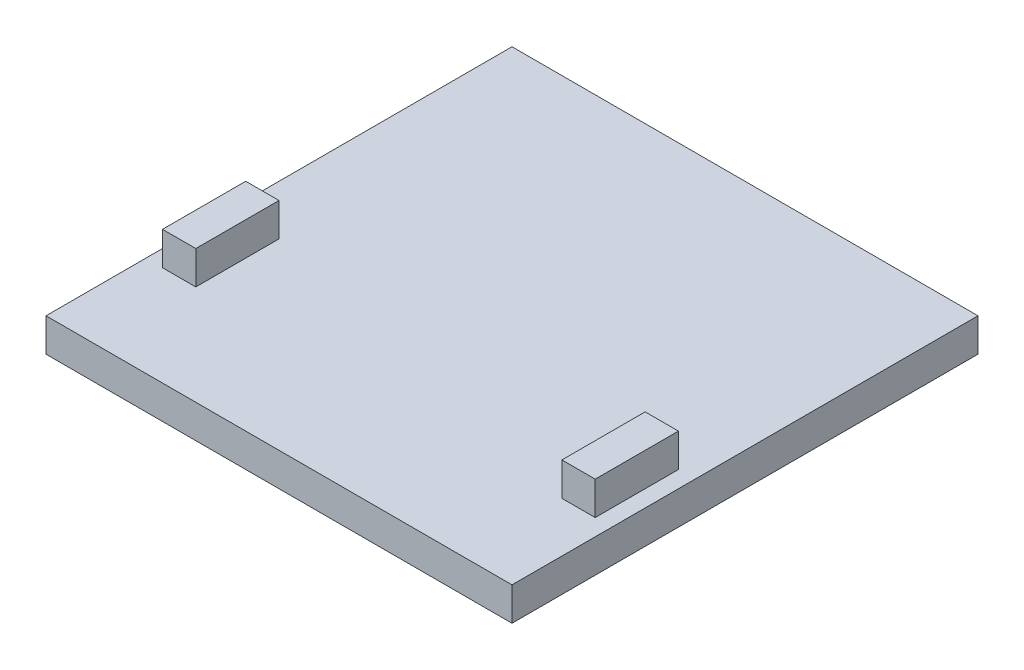
ISO-10303-21;
HEADER;
FILE_DESCRIPTION(('STEP AP214'),'2;1');
FILE_NAME('part.step','',(''),(''),'','','');
FILE_SCHEMA(('AUTOMOTIVE_DESIGN { 1 0 10303 214 1 1 1 1 }'));
ENDSEC;
DATA;
#1=APPLICATION_CONTEXT('core data for automotive mechanical design processes');
#2=APPLICATION_PROTOCOL_DEFINITION('international standard','automotive_design',2000,#1);
#3=PRODUCT_CONTEXT('',#1,'mechanical');
#4=PRODUCT('Part','Part','',(#3));
#5=PRODUCT_RELATED_PRODUCT_CATEGORY('part','',(#4));
#6=PRODUCT_DEFINITION_FORMATION('','',#4);
#7=PRODUCT_DEFINITION_CONTEXT('part definition',#1,'design');
#8=PRODUCT_DEFINITION('design','',#6,#7);
#9=PRODUCT_DEFINITION_SHAPE('','',#8);
#10=(LENGTH_UNIT() NAMED_UNIT(*) SI_UNIT(.MILLI.,.METRE.));
#11=(NAMED_UNIT(*) PLANE_ANGLE_UNIT() SI_UNIT($,.RADIAN.));
#12=(NAMED_UNIT(*) SI_UNIT($,.STERADIAN.) SOLID_ANGLE_UNIT());
#13=UNCERTAINTY_MEASURE_WITH_UNIT(LENGTH_MEASURE(1.E-05),#10,'distance_accuracy_value','');
#14=(GEOMETRIC_REPRESENTATION_CONTEXT(3) GLOBAL_UNCERTAINTY_ASSIGNED_CONTEXT((#13)) GLOBAL_UNIT_ASSIGNED_CONTEXT((#10,
#11,#12)) REPRESENTATION_CONTEXT('',''));
#15=CARTESIAN_POINT('',(0.,0.,0.));
#16=DIRECTION('',(0.,0.,1.));
#17=DIRECTION('',(1.,0.,0.));
#18=AXIS2_PLACEMENT_3D('',#15,#16,#17);
#19=CARTESIAN_POINT('',(0.,50.8,0.));
#20=DIRECTION('',(0.,-1.,0.));
#21=DIRECTION('',(0.,0.,-1.));
#22=AXIS2_PLACEMENT_3D('',#19,#20,#21);
#23=PLANE('',#22);
#24=DIRECTION('',(0.,0.,-1.));
#25=VECTOR('',#24,1.);
#26=CARTESIAN_POINT('',(330.2,50.8,203.2));
#27=LINE('',#26,#25);
#28=CARTESIAN_POINT('',(330.2,50.8,203.2));
#29=VERTEX_POINT('',#28);
#30=CARTESIAN_POINT('',(330.2,50.8,76.1999999999997));
#31=VERTEX_POINT('',#30);
#32=EDGE_CURVE('E145',#29,#31,#27,.T.);
#33=ORIENTED_EDGE('',*,*,#32,.F.);
#34=DIRECTION('',(1.,0.,0.));
#35=VECTOR('',#34,1.);
#36=CARTESIAN_POINT('',(330.2,50.8,203.2));
#37=LINE('',#36,#35);
#38=CARTESIAN_POINT('',(279.4,50.8,203.2));
#39=VERTEX_POINT('',#38);
#40=EDGE_CURVE('E158',#39,#29,#37,.T.);
#41=ORIENTED_EDGE('',*,*,#40,.F.);
#42=DIRECTION('',(0.,0.,1.));
#43=VECTOR('',#42,1.);
#44=CARTESIAN_POINT('',(279.4,50.8,203.2));
#45=LINE('',#44,#43);
#46=CARTESIAN_POINT('',(279.4,50.8,76.1999999999997));
#47=VERTEX_POINT('',#46);
#48=EDGE_CURVE('E167',#47,#39,#45,.T.);
#49=ORIENTED_EDGE('',*,*,#48,.F.);
#50=DIRECTION('',(-1.,0.,0.));
#51=VECTOR('',#50,1.);
#52=CARTESIAN_POINT('',(330.2,50.8,76.1999999999997));
#53=LINE('',#52,#51);
#54=EDGE_CURVE('E148',#31,#47,#53,.T.);
#55=ORIENTED_EDGE('',*,*,#54,.F.);
#56=EDGE_LOOP('',(#33,#41,#49,#55));
#57=FACE_BOUND('',#56,.T.);
#58=DIRECTION('',(0.,0.,-1.));
#59=VECTOR('',#58,1.);
#60=CARTESIAN_POINT('',(355.6,50.8,355.6));
#61=LINE('',#60,#59);
#62=CARTESIAN_POINT('',(355.6,50.8,355.6));
#63=VERTEX_POINT('',#62);
#64=CARTESIAN_POINT('',(355.6,50.8,-355.6));
#65=VERTEX_POINT('',#64);
#66=EDGE_CURVE('E184',#63,#65,#61,.T.);
#67=ORIENTED_EDGE('',*,*,#66,.T.);
#68=DIRECTION('',(-1.,0.,0.));
#69=VECTOR('',#68,1.);
#70=CARTESIAN_POINT('',(-355.6,50.8,-355.6));
#71=LINE('',#70,#69);
#72=CARTESIAN_POINT('',(-355.6,50.8,-355.6));
#73=VERTEX_POINT('',#72);
#74=EDGE_CURVE('E187',#65,#73,#71,.T.);
#75=ORIENTED_EDGE('',*,*,#74,.T.);
#76=DIRECTION('',(0.,0.,1.));
#77=VECTOR('',#76,1.);
#78=CARTESIAN_POINT('',(-355.6,50.8,355.6));
#79=LINE('',#78,#77);
#80=CARTESIAN_POINT('',(-355.6,50.8,355.6));
#81=VERTEX_POINT('',#80);
#82=EDGE_CURVE('E190',#73,#81,#79,.T.);
#83=ORIENTED_EDGE('',*,*,#82,.T.);
#84=DIRECTION('',(1.,0.,0.));
#85=VECTOR('',#84,1.);
#86=CARTESIAN_POINT('',(-355.6,50.8,355.6));
#87=LINE('',#86,#85);
#88=EDGE_CURVE('E192',#81,#63,#87,.T.);
#89=ORIENTED_EDGE('',*,*,#88,.T.);
#90=EDGE_LOOP('',(#67,#75,#83,#89));
#91=FACE_BOUND('',#90,.T.);
#92=DIRECTION('',(1.,0.,0.));
#93=VECTOR('',#92,1.);
#94=CARTESIAN_POINT('',(-330.2,50.8,203.2));
#95=LINE('',#94,#93);
#96=CARTESIAN_POINT('',(-330.2,50.8,203.2));
#97=VERTEX_POINT('',#96);
#98=CARTESIAN_POINT('',(-279.4,50.8,203.2));
#99=VERTEX_POINT('',#98);
#100=EDGE_CURVE('E144',#97,#99,#95,.T.);
#101=ORIENTED_EDGE('',*,*,#100,.F.);
#102=DIRECTION('',(0.,0.,1.));
#103=VECTOR('',#102,1.);
#104=CARTESIAN_POINT('',(-330.2,50.8,203.2));
#105=LINE('',#104,#103);
#106=CARTESIAN_POINT('',(-330.2,50.8,76.1999999999997));
#107=VERTEX_POINT('',#106);
#108=EDGE_CURVE('E141',#107,#97,#105,.T.);
#109=ORIENTED_EDGE('',*,*,#108,.F.);
#110=DIRECTION('',(-1.,0.,0.));
#111=VECTOR('',#110,1.);
#112=CARTESIAN_POINT('',(-330.2,50.8,76.1999999999997));
#113=LINE('',#112,#111);
#114=CARTESIAN_POINT('',(-279.4,50.8,76.1999999999997));
#115=VERTEX_POINT('',#114);
#116=EDGE_CURVE('E55',#115,#107,#113,.T.);
#117=ORIENTED_EDGE('',*,*,#116,.F.);
#118=DIRECTION('',(0.,0.,-1.));
#119=VECTOR('',#118,1.);
#120=CARTESIAN_POINT('',(-279.4,50.8,203.2));
#121=LINE('',#120,#119);
#122=EDGE_CURVE('E50',#99,#115,#121,.T.);
#123=ORIENTED_EDGE('',*,*,#122,.F.);
#124=EDGE_LOOP('',(#101,#109,#117,#123));
#125=FACE_BOUND('',#124,.T.);
#126=ADVANCED_FACE('F35',(#57,#91,#125),#23,.F.);
#127=CARTESIAN_POINT('',(355.6,50.8,355.6));
#128=DIRECTION('',(-1.,0.,0.));
#129=DIRECTION('',(0.,0.,1.));
#130=AXIS2_PLACEMENT_3D('',#127,#128,#129);
#131=PLANE('',#130);
#132=DIRECTION('',(0.,0.,-1.));
#133=VECTOR('',#132,1.);
#134=CARTESIAN_POINT('',(355.6,0.,355.6));
#135=LINE('',#134,#133);
#136=CARTESIAN_POINT('',(355.6,0.,355.6));
#137=VERTEX_POINT('',#136);
#138=CARTESIAN_POINT('',(355.6,0.,-355.6));
#139=VERTEX_POINT('',#138);
#140=EDGE_CURVE('E183',#137,#139,#135,.T.);
#141=ORIENTED_EDGE('',*,*,#140,.T.);
#142=DIRECTION('',(0.,-1.,0.));
#143=VECTOR('',#142,1.);
#144=CARTESIAN_POINT('',(355.6,50.8,-355.6));
#145=LINE('',#144,#143);
#146=EDGE_CURVE('E11',#65,#139,#145,.T.);
#147=ORIENTED_EDGE('',*,*,#146,.F.);
#148=ORIENTED_EDGE('',*,*,#66,.F.);
#149=DIRECTION('',(0.,-1.,0.));
#150=VECTOR('',#149,1.);
#151=CARTESIAN_POINT('',(355.6,50.8,355.6));
#152=LINE('',#151,#150);
#153=EDGE_CURVE('E194',#63,#137,#152,.T.);
#154=ORIENTED_EDGE('',*,*,#153,.T.);
#155=EDGE_LOOP('',(#141,#147,#148,#154));
#156=FACE_BOUND('',#155,.T.);
#157=ADVANCED_FACE('F37',(#156),#131,.F.);
#158=CARTESIAN_POINT('',(-355.6,50.8,-355.6));
#159=DIRECTION('',(0.,0.,1.));
#160=DIRECTION('',(1.,0.,0.));
#161=AXIS2_PLACEMENT_3D('',#158,#159,#160);
#162=PLANE('',#161);
#163=DIRECTION('',(-1.,0.,0.));
#164=VECTOR('',#163,1.);
#165=CARTESIAN_POINT('',(-355.6,0.,-355.6));
#166=LINE('',#165,#164);
#167=CARTESIAN_POINT('',(-355.6,0.,-355.6));
#168=VERTEX_POINT('',#167);
#169=EDGE_CURVE('E197',#139,#168,#166,.T.);
#170=ORIENTED_EDGE('',*,*,#169,.T.);
#171=DIRECTION('',(0.,-1.,0.));
#172=VECTOR('',#171,1.);
#173=CARTESIAN_POINT('',(-355.6,50.8,-355.6));
#174=LINE('',#173,#172);
#175=EDGE_CURVE('E43',#73,#168,#174,.T.);
#176=ORIENTED_EDGE('',*,*,#175,.F.);
#177=ORIENTED_EDGE('',*,*,#74,.F.);
#178=ORIENTED_EDGE('',*,*,#146,.T.);
#179=EDGE_LOOP('',(#170,#176,#177,#178));
#180=FACE_BOUND('',#179,.T.);
#181=ADVANCED_FACE('F226',(#180),#162,.F.);
#182=CARTESIAN_POINT('',(-355.6,50.8,355.6));
#183=DIRECTION('',(1.,0.,0.));
#184=DIRECTION('',(0.,0.,-1.));
#185=AXIS2_PLACEMENT_3D('',#182,#183,#184);
#186=PLANE('',#185);
#187=DIRECTION('',(0.,0.,1.));
#188=VECTOR('',#187,1.);
#189=CARTESIAN_POINT('',(-355.6,0.,355.6));
#190=LINE('',#189,#188);
#191=CARTESIAN_POINT('',(-355.6,0.,355.6));
#192=VERTEX_POINT('',#191);
#193=EDGE_CURVE('E199',#168,#192,#190,.T.);
#194=ORIENTED_EDGE('',*,*,#193,.T.);
#195=DIRECTION('',(0.,-1.,0.));
#196=VECTOR('',#195,1.);
#197=CARTESIAN_POINT('',(-355.6,50.8,355.6));
#198=LINE('',#197,#196);
#199=EDGE_CURVE('E204',#81,#192,#198,.T.);
#200=ORIENTED_EDGE('',*,*,#199,.F.);
#201=ORIENTED_EDGE('',*,*,#82,.F.);
#202=ORIENTED_EDGE('',*,*,#175,.T.);
#203=EDGE_LOOP('',(#194,#200,#201,#202));
#204=FACE_BOUND('',#203,.T.);
#205=ADVANCED_FACE('F211',(#204),#186,.F.);
#206=CARTESIAN_POINT('',(-355.6,50.8,355.6));
#207=DIRECTION('',(0.,0.,-1.));
#208=DIRECTION('',(-1.,0.,0.));
#209=AXIS2_PLACEMENT_3D('',#206,#207,#208);
#210=PLANE('',#209);
#211=DIRECTION('',(1.,0.,0.));
#212=VECTOR('',#211,1.);
#213=CARTESIAN_POINT('',(-355.6,0.,355.6));
#214=LINE('',#213,#212);
#215=EDGE_CURVE('E188',#192,#137,#214,.T.);
#216=ORIENTED_EDGE('',*,*,#215,.T.);
#217=ORIENTED_EDGE('',*,*,#153,.F.);
#218=ORIENTED_EDGE('',*,*,#88,.F.);
#219=ORIENTED_EDGE('',*,*,#199,.T.);
#220=EDGE_LOOP('',(#216,#217,#218,#219));
#221=FACE_BOUND('',#220,.T.);
#222=ADVANCED_FACE('F220',(#221),#210,.F.);
#223=CARTESIAN_POINT('',(0.,0.,0.));
#224=DIRECTION('',(0.,-1.,0.));
#225=DIRECTION('',(0.,0.,-1.));
#226=AXIS2_PLACEMENT_3D('',#223,#224,#225);
#227=PLANE('',#226);
#228=ORIENTED_EDGE('',*,*,#140,.F.);
#229=ORIENTED_EDGE('',*,*,#215,.F.);
#230=ORIENTED_EDGE('',*,*,#193,.F.);
#231=ORIENTED_EDGE('',*,*,#169,.F.);
#232=EDGE_LOOP('',(#228,#229,#230,#231));
#233=FACE_BOUND('',#232,.T.);
#234=ADVANCED_FACE('F217',(#233),#227,.T.);
#235=CARTESIAN_POINT('',(330.2,101.6,203.2));
#236=DIRECTION('',(-1.,0.,0.));
#237=DIRECTION('',(0.,0.,1.));
#238=AXIS2_PLACEMENT_3D('',#235,#236,#237);
#239=PLANE('',#238);
#240=ORIENTED_EDGE('',*,*,#32,.T.);
#241=DIRECTION('',(0.,-1.,0.));
#242=VECTOR('',#241,1.);
#243=CARTESIAN_POINT('',(330.2,101.6,76.1999999999997));
#244=LINE('',#243,#242);
#245=CARTESIAN_POINT('',(330.2,101.6,76.1999999999997));
#246=VERTEX_POINT('',#245);
#247=EDGE_CURVE('E180',#246,#31,#244,.T.);
#248=ORIENTED_EDGE('',*,*,#247,.F.);
#249=DIRECTION('',(0.,0.,-1.));
#250=VECTOR('',#249,1.);
#251=CARTESIAN_POINT('',(330.2,101.6,203.2));
#252=LINE('',#251,#250);
#253=CARTESIAN_POINT('',(330.2,101.6,203.2));
#254=VERTEX_POINT('',#253);
#255=EDGE_CURVE('E154',#254,#246,#252,.T.);
#256=ORIENTED_EDGE('',*,*,#255,.F.);
#257=DIRECTION('',(0.,-1.,0.));
#258=VECTOR('',#257,1.);
#259=CARTESIAN_POINT('',(330.2,101.6,203.2));
#260=LINE('',#259,#258);
#261=EDGE_CURVE('E163',#254,#29,#260,.T.);
#262=ORIENTED_EDGE('',*,*,#261,.T.);
#263=EDGE_LOOP('',(#240,#248,#256,#262));
#264=FACE_BOUND('',#263,.T.);
#265=ADVANCED_FACE('F240',(#264),#239,.F.);
#266=CARTESIAN_POINT('',(330.2,101.6,76.1999999999997));
#267=DIRECTION('',(0.,0.,1.));
#268=DIRECTION('',(1.,0.,0.));
#269=AXIS2_PLACEMENT_3D('',#266,#267,#268);
#270=PLANE('',#269);
#271=ORIENTED_EDGE('',*,*,#54,.T.);
#272=DIRECTION('',(0.,-1.,0.));
#273=VECTOR('',#272,1.);
#274=CARTESIAN_POINT('',(279.4,101.6,76.1999999999997));
#275=LINE('',#274,#273);
#276=CARTESIAN_POINT('',(279.4,101.6,76.1999999999997));
#277=VERTEX_POINT('',#276);
#278=EDGE_CURVE('E177',#277,#47,#275,.T.);
#279=ORIENTED_EDGE('',*,*,#278,.F.);
#280=DIRECTION('',(-1.,0.,0.));
#281=VECTOR('',#280,1.);
#282=CARTESIAN_POINT('',(330.2,101.6,76.1999999999997));
#283=LINE('',#282,#281);
#284=EDGE_CURVE('E157',#246,#277,#283,.T.);
#285=ORIENTED_EDGE('',*,*,#284,.F.);
#286=ORIENTED_EDGE('',*,*,#247,.T.);
#287=EDGE_LOOP('',(#271,#279,#285,#286));
#288=FACE_BOUND('',#287,.T.);
#289=ADVANCED_FACE('F259',(#288),#270,.F.);
#290=CARTESIAN_POINT('',(279.4,101.6,203.2));
#291=DIRECTION('',(1.,0.,0.));
#292=DIRECTION('',(0.,0.,-1.));
#293=AXIS2_PLACEMENT_3D('',#290,#291,#292);
#294=PLANE('',#293);
#295=ORIENTED_EDGE('',*,*,#48,.T.);
#296=DIRECTION('',(0.,-1.,0.));
#297=VECTOR('',#296,1.);
#298=CARTESIAN_POINT('',(279.4,101.6,203.2));
#299=LINE('',#298,#297);
#300=CARTESIAN_POINT('',(279.4,101.6,203.2));
#301=VERTEX_POINT('',#300);
#302=EDGE_CURVE('E174',#301,#39,#299,.T.);
#303=ORIENTED_EDGE('',*,*,#302,.F.);
#304=DIRECTION('',(0.,0.,1.));
#305=VECTOR('',#304,1.);
#306=CARTESIAN_POINT('',(279.4,101.6,203.2));
#307=LINE('',#306,#305);
#308=EDGE_CURVE('E160',#277,#301,#307,.T.);
#309=ORIENTED_EDGE('',*,*,#308,.F.);
#310=ORIENTED_EDGE('',*,*,#278,.T.);
#311=EDGE_LOOP('',(#295,#303,#309,#310));
#312=FACE_BOUND('',#311,.T.);
#313=ADVANCED_FACE('F266',(#312),#294,.F.);
#314=CARTESIAN_POINT('',(330.2,101.6,203.2));
#315=DIRECTION('',(0.,0.,-1.));
#316=DIRECTION('',(-1.,0.,0.));
#317=AXIS2_PLACEMENT_3D('',#314,#315,#316);
#318=PLANE('',#317);
#319=ORIENTED_EDGE('',*,*,#40,.T.);
#320=ORIENTED_EDGE('',*,*,#261,.F.);
#321=DIRECTION('',(1.,0.,0.));
#322=VECTOR('',#321,1.);
#323=CARTESIAN_POINT('',(330.2,101.6,203.2));
#324=LINE('',#323,#322);
#325=EDGE_CURVE('E162',#301,#254,#324,.T.);
#326=ORIENTED_EDGE('',*,*,#325,.F.);
#327=ORIENTED_EDGE('',*,*,#302,.T.);
#328=EDGE_LOOP('',(#319,#320,#326,#327));
#329=FACE_BOUND('',#328,.T.);
#330=ADVANCED_FACE('F273',(#329),#318,.F.);
#331=CARTESIAN_POINT('',(0.,101.6,0.));
#332=DIRECTION('',(0.,1.,0.));
#333=DIRECTION('',(0.,0.,1.));
#334=AXIS2_PLACEMENT_3D('',#331,#332,#333);
#335=PLANE('',#334);
#336=ORIENTED_EDGE('',*,*,#255,.T.);
#337=ORIENTED_EDGE('',*,*,#284,.T.);
#338=ORIENTED_EDGE('',*,*,#308,.T.);
#339=ORIENTED_EDGE('',*,*,#325,.T.);
#340=EDGE_LOOP('',(#336,#337,#338,#339));
#341=FACE_BOUND('',#340,.T.);
#342=ADVANCED_FACE('F281',(#341),#335,.T.);
#343=CARTESIAN_POINT('',(-330.2,101.6,203.2));
#344=DIRECTION('',(0.,0.,-1.));
#345=DIRECTION('',(-1.,0.,0.));
#346=AXIS2_PLACEMENT_3D('',#343,#344,#345);
#347=PLANE('',#346);
#348=ORIENTED_EDGE('',*,*,#100,.T.);
#349=DIRECTION('',(0.,-1.,0.));
#350=VECTOR('',#349,1.);
#351=CARTESIAN_POINT('',(-279.4,101.6,203.2));
#352=LINE('',#351,#350);
#353=CARTESIAN_POINT('',(-279.4,101.6,203.2));
#354=VERTEX_POINT('',#353);
#355=EDGE_CURVE('E125',#354,#99,#352,.T.);
#356=ORIENTED_EDGE('',*,*,#355,.F.);
#357=DIRECTION('',(1.,0.,0.));
#358=VECTOR('',#357,1.);
#359=CARTESIAN_POINT('',(-330.2,101.6,203.2));
#360=LINE('',#359,#358);
#361=CARTESIAN_POINT('',(-330.2,101.6,203.2));
#362=VERTEX_POINT('',#361);
#363=EDGE_CURVE('E132',#362,#354,#360,.T.);
#364=ORIENTED_EDGE('',*,*,#363,.F.);
#365=DIRECTION('',(0.,-1.,0.));
#366=VECTOR('',#365,1.);
#367=CARTESIAN_POINT('',(-330.2,101.6,203.2));
#368=LINE('',#367,#366);
#369=EDGE_CURVE('E370',#362,#97,#368,.T.);
#370=ORIENTED_EDGE('',*,*,#369,.T.);
#371=EDGE_LOOP('',(#348,#356,#364,#370));
#372=FACE_BOUND('',#371,.T.);
#373=ADVANCED_FACE('F143',(#372),#347,.F.);
#374=CARTESIAN_POINT('',(-279.4,101.6,203.2));
#375=DIRECTION('',(-1.,0.,0.));
#376=DIRECTION('',(0.,0.,1.));
#377=AXIS2_PLACEMENT_3D('',#374,#375,#376);
#378=PLANE('',#377);
#379=ORIENTED_EDGE('',*,*,#122,.T.);
#380=DIRECTION('',(0.,-1.,0.));
#381=VECTOR('',#380,1.);
#382=CARTESIAN_POINT('',(-279.4,101.6,76.1999999999997));
#383=LINE('',#382,#381);
#384=CARTESIAN_POINT('',(-279.4,101.6,76.1999999999997));
#385=VERTEX_POINT('',#384);
#386=EDGE_CURVE('E128',#385,#115,#383,.T.);
#387=ORIENTED_EDGE('',*,*,#386,.F.);
#388=DIRECTION('',(0.,0.,-1.));
#389=VECTOR('',#388,1.);
#390=CARTESIAN_POINT('',(-279.4,101.6,203.2));
#391=LINE('',#390,#389);
#392=EDGE_CURVE('E121',#354,#385,#391,.T.);
#393=ORIENTED_EDGE('',*,*,#392,.F.);
#394=ORIENTED_EDGE('',*,*,#355,.T.);
#395=EDGE_LOOP('',(#379,#387,#393,#394));
#396=FACE_BOUND('',#395,.T.);
#397=ADVANCED_FACE('F123',(#396),#378,.F.);
#398=CARTESIAN_POINT('',(-330.2,101.6,76.1999999999997));
#399=DIRECTION('',(0.,0.,1.));
#400=DIRECTION('',(1.,0.,0.));
#401=AXIS2_PLACEMENT_3D('',#398,#399,#400);
#402=PLANE('',#401);
#403=ORIENTED_EDGE('',*,*,#116,.T.);
#404=DIRECTION('',(0.,-1.,0.));
#405=VECTOR('',#404,1.);
#406=CARTESIAN_POINT('',(-330.2,101.6,76.1999999999997));
#407=LINE('',#406,#405);
#408=CARTESIAN_POINT('',(-330.2,101.6,76.1999999999997));
#409=VERTEX_POINT('',#408);
#410=EDGE_CURVE('E150',#409,#107,#407,.T.);
#411=ORIENTED_EDGE('',*,*,#410,.F.);
#412=DIRECTION('',(-1.,0.,0.));
#413=VECTOR('',#412,1.);
#414=CARTESIAN_POINT('',(-330.2,101.6,76.1999999999997));
#415=LINE('',#414,#413);
#416=EDGE_CURVE('E131',#385,#409,#415,.T.);
#417=ORIENTED_EDGE('',*,*,#416,.F.);
#418=ORIENTED_EDGE('',*,*,#386,.T.);
#419=EDGE_LOOP('',(#403,#411,#417,#418));
#420=FACE_BOUND('',#419,.T.);
#421=ADVANCED_FACE('F302',(#420),#402,.F.);
#422=CARTESIAN_POINT('',(-330.2,101.6,203.2));
#423=DIRECTION('',(1.,0.,0.));
#424=DIRECTION('',(0.,0.,-1.));
#425=AXIS2_PLACEMENT_3D('',#422,#423,#424);
#426=PLANE('',#425);
#427=ORIENTED_EDGE('',*,*,#108,.T.);
#428=ORIENTED_EDGE('',*,*,#369,.F.);
#429=DIRECTION('',(0.,0.,1.));
#430=VECTOR('',#429,1.);
#431=CARTESIAN_POINT('',(-330.2,101.6,203.2));
#432=LINE('',#431,#430);
#433=EDGE_CURVE('E137',#409,#362,#432,.T.);
#434=ORIENTED_EDGE('',*,*,#433,.F.);
#435=ORIENTED_EDGE('',*,*,#410,.T.);
#436=EDGE_LOOP('',(#427,#428,#434,#435));
#437=FACE_BOUND('',#436,.T.);
#438=ADVANCED_FACE('F309',(#437),#426,.F.);
#439=CARTESIAN_POINT('',(0.,101.6,0.));
#440=DIRECTION('',(0.,1.,0.));
#441=DIRECTION('',(0.,0.,1.));
#442=AXIS2_PLACEMENT_3D('',#439,#440,#441);
#443=PLANE('',#442);
#444=ORIENTED_EDGE('',*,*,#363,.T.);
#445=ORIENTED_EDGE('',*,*,#392,.T.);
#446=ORIENTED_EDGE('',*,*,#416,.T.);
#447=ORIENTED_EDGE('',*,*,#433,.T.);
#448=EDGE_LOOP('',(#444,#445,#446,#447));
#449=FACE_BOUND('',#448,.T.);
#450=ADVANCED_FACE('F135',(#449),#443,.T.);
#451=CLOSED_SHELL('',(#126,#157,#181,#205,#222,#234,#265,#289,#313,#330,#342,#373,#397,#421,
#438,#450));
#452=MANIFOLD_SOLID_BREP('B2',#451);
#453=ADVANCED_BREP_SHAPE_REPRESENTATION('',(#18,#452),#14);
#454=SHAPE_DEFINITION_REPRESENTATION(#9,#453);
ENDSEC;
END-ISO-10303-21;
